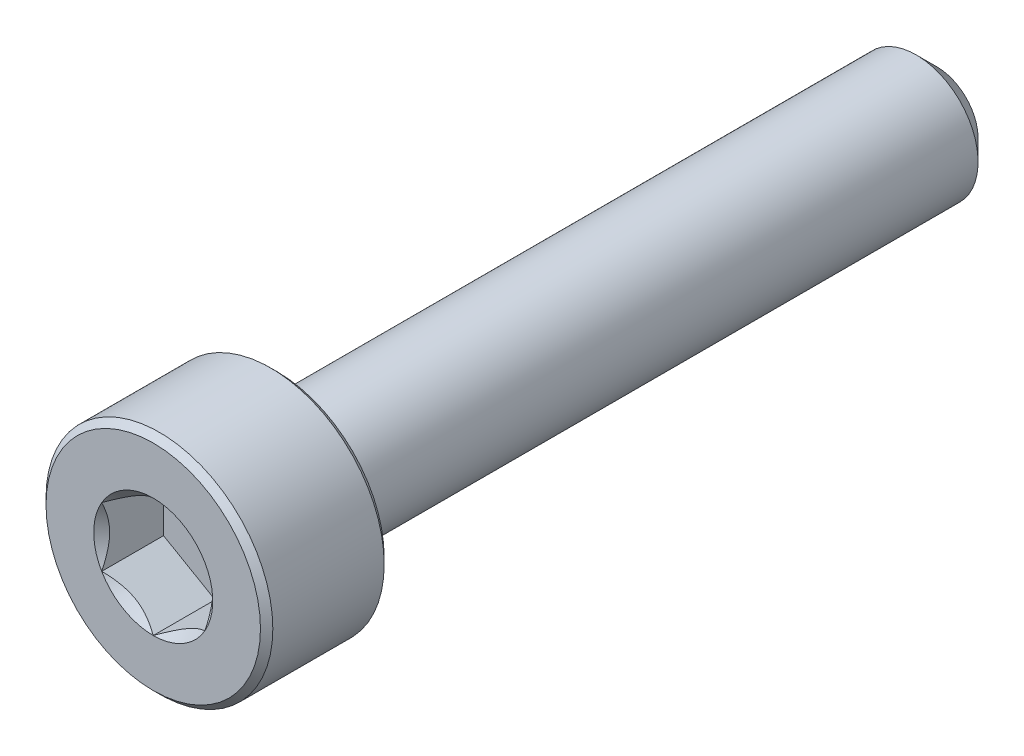
ISO-10303-21;
HEADER;
FILE_DESCRIPTION(('STEP AP214'),'2;1');
FILE_NAME('part.step','',(''),(''),'','','');
FILE_SCHEMA(('AUTOMOTIVE_DESIGN { 1 0 10303 214 1 1 1 1 }'));
ENDSEC;
DATA;
#1=APPLICATION_CONTEXT('core data for automotive mechanical design processes');
#2=APPLICATION_PROTOCOL_DEFINITION('international standard','automotive_design',2000,#1);
#3=PRODUCT_CONTEXT('',#1,'mechanical');
#4=PRODUCT('Part','Part','',(#3));
#5=PRODUCT_RELATED_PRODUCT_CATEGORY('part','',(#4));
#6=PRODUCT_DEFINITION_FORMATION('','',#4);
#7=PRODUCT_DEFINITION_CONTEXT('part definition',#1,'design');
#8=PRODUCT_DEFINITION('design','',#6,#7);
#9=PRODUCT_DEFINITION_SHAPE('','',#8);
#10=(LENGTH_UNIT() NAMED_UNIT(*) SI_UNIT(.MILLI.,.METRE.));
#11=(NAMED_UNIT(*) PLANE_ANGLE_UNIT() SI_UNIT($,.RADIAN.));
#12=(NAMED_UNIT(*) SI_UNIT($,.STERADIAN.) SOLID_ANGLE_UNIT());
#13=UNCERTAINTY_MEASURE_WITH_UNIT(LENGTH_MEASURE(1.E-05),#10,'distance_accuracy_value','');
#14=(GEOMETRIC_REPRESENTATION_CONTEXT(3) GLOBAL_UNCERTAINTY_ASSIGNED_CONTEXT((#13)) GLOBAL_UNIT_ASSIGNED_CONTEXT((#10,
#11,#12)) REPRESENTATION_CONTEXT('',''));
#15=CARTESIAN_POINT('',(0.,0.,0.));
#16=DIRECTION('',(0.,0.,1.));
#17=DIRECTION('',(1.,0.,0.));
#18=AXIS2_PLACEMENT_3D('',#15,#16,#17);
#19=CARTESIAN_POINT('',(0.,2.6,9.5));
#20=DIRECTION('',(0.,0.,1.));
#21=DIRECTION('',(1.,0.,0.));
#22=AXIS2_PLACEMENT_3D('',#19,#20,#21);
#23=PLANE('',#22);
#24=CARTESIAN_POINT('',(0.,0.,9.5));
#25=DIRECTION('',(0.,0.,1.));
#26=DIRECTION('',(1.,0.,0.));
#27=AXIS2_PLACEMENT_3D('',#24,#25,#26);
#28=CIRCLE('',#27,1.44337567297406);
#29=CARTESIAN_POINT('',(1.25,0.721687836487032,9.5));
#30=VERTEX_POINT('',#29);
#31=CARTESIAN_POINT('',(0.,1.44337567297406,9.5));
#32=VERTEX_POINT('',#31);
#33=EDGE_CURVE('E92',#30,#32,#28,.T.);
#34=ORIENTED_EDGE('',*,*,#33,.F.);
#35=CARTESIAN_POINT('',(1.25,-0.721687836487033,9.5));
#36=VERTEX_POINT('',#35);
#37=EDGE_CURVE('E52',#36,#30,#28,.T.);
#38=ORIENTED_EDGE('',*,*,#37,.F.);
#39=CARTESIAN_POINT('',(0.,-1.44337567297406,9.5));
#40=VERTEX_POINT('',#39);
#41=EDGE_CURVE('E278',#40,#36,#28,.T.);
#42=ORIENTED_EDGE('',*,*,#41,.F.);
#43=CARTESIAN_POINT('',(-1.25,-0.72168783648703,9.5));
#44=VERTEX_POINT('',#43);
#45=EDGE_CURVE('E59',#44,#40,#28,.T.);
#46=ORIENTED_EDGE('',*,*,#45,.F.);
#47=CARTESIAN_POINT('',(-1.25,0.721687836487034,9.5));
#48=VERTEX_POINT('',#47);
#49=EDGE_CURVE('E128',#48,#44,#28,.T.);
#50=ORIENTED_EDGE('',*,*,#49,.F.);
#51=EDGE_CURVE('E101',#32,#48,#28,.T.);
#52=ORIENTED_EDGE('',*,*,#51,.F.);
#53=EDGE_LOOP('',(#34,#38,#42,#46,#50,#52));
#54=FACE_BOUND('',#53,.T.);
#55=CARTESIAN_POINT('',(0.,0.,9.5));
#56=DIRECTION('',(0.,0.,-1.));
#57=DIRECTION('',(-1.,0.,0.));
#58=AXIS2_PLACEMENT_3D('',#55,#56,#57);
#59=CIRCLE('',#58,2.6);
#60=CARTESIAN_POINT('',(-2.6,0.,9.5));
#61=VERTEX_POINT('',#60);
#62=EDGE_CURVE('E46',#61,#61,#59,.T.);
#63=ORIENTED_EDGE('',*,*,#62,.F.);
#64=EDGE_LOOP('',(#63));
#65=FACE_BOUND('',#64,.T.);
#66=ADVANCED_FACE('F33',(#54,#65),#23,.T.);
#67=CARTESIAN_POINT('',(0.,0.,9.35));
#68=DIRECTION('',(0.,0.,-1.));
#69=DIRECTION('',(-1.,0.,0.));
#70=AXIS2_PLACEMENT_3D('',#67,#68,#69);
#71=CONICAL_SURFACE('',#70,2.75,0.785398163397445);
#72=ORIENTED_EDGE('',*,*,#62,.T.);
#73=EDGE_LOOP('',(#72));
#74=FACE_BOUND('',#73,.T.);
#75=CARTESIAN_POINT('',(0.,0.,9.35));
#76=DIRECTION('',(0.,0.,-1.));
#77=DIRECTION('',(-1.,0.,0.));
#78=AXIS2_PLACEMENT_3D('',#75,#76,#77);
#79=CIRCLE('',#78,2.75);
#80=CARTESIAN_POINT('',(-2.75,0.,9.35));
#81=VERTEX_POINT('',#80);
#82=EDGE_CURVE('E212',#81,#81,#79,.T.);
#83=ORIENTED_EDGE('',*,*,#82,.F.);
#84=EDGE_LOOP('',(#83));
#85=FACE_BOUND('',#84,.T.);
#86=ADVANCED_FACE('F217',(#74,#85),#71,.T.);
#87=CARTESIAN_POINT('',(0.,0.,-9.5));
#88=DIRECTION('',(0.,0.,-1.));
#89=DIRECTION('',(-1.,0.,0.));
#90=AXIS2_PLACEMENT_3D('',#87,#88,#89);
#91=CYLINDRICAL_SURFACE('',#90,2.75);
#92=ORIENTED_EDGE('',*,*,#82,.T.);
#93=EDGE_LOOP('',(#92));
#94=FACE_BOUND('',#93,.T.);
#95=CARTESIAN_POINT('',(0.,0.,6.65));
#96=DIRECTION('',(0.,0.,-1.));
#97=DIRECTION('',(-1.,0.,0.));
#98=AXIS2_PLACEMENT_3D('',#95,#96,#97);
#99=CIRCLE('',#98,2.75);
#100=CARTESIAN_POINT('',(-2.75,0.,6.65));
#101=VERTEX_POINT('',#100);
#102=EDGE_CURVE('E209',#101,#101,#99,.T.);
#103=ORIENTED_EDGE('',*,*,#102,.F.);
#104=EDGE_LOOP('',(#103));
#105=FACE_BOUND('',#104,.T.);
#106=ADVANCED_FACE('F223',(#94,#105),#91,.T.);
#107=CARTESIAN_POINT('',(0.,0.,6.5));
#108=DIRECTION('',(0.,0.,1.));
#109=DIRECTION('',(1.,0.,0.));
#110=AXIS2_PLACEMENT_3D('',#107,#108,#109);
#111=CONICAL_SURFACE('',#110,2.6,0.785398163397445);
#112=ORIENTED_EDGE('',*,*,#102,.T.);
#113=EDGE_LOOP('',(#112));
#114=FACE_BOUND('',#113,.T.);
#115=CARTESIAN_POINT('',(0.,0.,6.5));
#116=DIRECTION('',(0.,0.,-1.));
#117=DIRECTION('',(-1.,0.,0.));
#118=AXIS2_PLACEMENT_3D('',#115,#116,#117);
#119=CIRCLE('',#118,2.6);
#120=CARTESIAN_POINT('',(-2.6,0.,6.5));
#121=VERTEX_POINT('',#120);
#122=EDGE_CURVE('E206',#121,#121,#119,.T.);
#123=ORIENTED_EDGE('',*,*,#122,.F.);
#124=EDGE_LOOP('',(#123));
#125=FACE_BOUND('',#124,.T.);
#126=ADVANCED_FACE('F227',(#114,#125),#111,.T.);
#127=CARTESIAN_POINT('',(0.,2.6,6.5));
#128=DIRECTION('',(0.,0.,-1.));
#129=DIRECTION('',(-1.,0.,0.));
#130=AXIS2_PLACEMENT_3D('',#127,#128,#129);
#131=PLANE('',#130);
#132=ORIENTED_EDGE('',*,*,#122,.T.);
#133=EDGE_LOOP('',(#132));
#134=FACE_BOUND('',#133,.T.);
#135=CARTESIAN_POINT('',(0.,0.,6.5));
#136=DIRECTION('',(0.,0.,-1.));
#137=DIRECTION('',(-1.,0.,0.));
#138=AXIS2_PLACEMENT_3D('',#135,#136,#137);
#139=CIRCLE('',#138,1.5);
#140=CARTESIAN_POINT('',(-1.5,0.,6.5));
#141=VERTEX_POINT('',#140);
#142=EDGE_CURVE('E203',#141,#141,#139,.T.);
#143=ORIENTED_EDGE('',*,*,#142,.F.);
#144=EDGE_LOOP('',(#143));
#145=FACE_BOUND('',#144,.T.);
#146=ADVANCED_FACE('F233',(#134,#145),#131,.T.);
#147=CARTESIAN_POINT('',(0.,0.,-9.5));
#148=DIRECTION('',(0.,0.,-1.));
#149=DIRECTION('',(-1.,0.,0.));
#150=AXIS2_PLACEMENT_3D('',#147,#148,#149);
#151=CYLINDRICAL_SURFACE('',#150,1.5);
#152=ORIENTED_EDGE('',*,*,#142,.T.);
#153=EDGE_LOOP('',(#152));
#154=FACE_BOUND('',#153,.T.);
#155=CARTESIAN_POINT('',(0.,0.,-8.99999999999999));
#156=DIRECTION('',(0.,0.,-1.));
#157=DIRECTION('',(-1.,0.,0.));
#158=AXIS2_PLACEMENT_3D('',#155,#156,#157);
#159=CIRCLE('',#158,1.5);
#160=CARTESIAN_POINT('',(-1.5,0.,-8.99999999999999));
#161=VERTEX_POINT('',#160);
#162=EDGE_CURVE('E200',#161,#161,#159,.T.);
#163=ORIENTED_EDGE('',*,*,#162,.F.);
#164=EDGE_LOOP('',(#163));
#165=FACE_BOUND('',#164,.T.);
#166=ADVANCED_FACE('F237',(#154,#165),#151,.T.);
#167=CARTESIAN_POINT('',(0.,0.,-9.5));
#168=DIRECTION('',(0.,0.,1.));
#169=DIRECTION('',(1.,0.,0.));
#170=AXIS2_PLACEMENT_3D('',#167,#168,#169);
#171=CONICAL_SURFACE('',#170,1.,0.785398163397443);
#172=ORIENTED_EDGE('',*,*,#162,.T.);
#173=EDGE_LOOP('',(#172));
#174=FACE_BOUND('',#173,.T.);
#175=CARTESIAN_POINT('',(0.,0.,-9.5));
#176=DIRECTION('',(0.,0.,-1.));
#177=DIRECTION('',(-1.,0.,0.));
#178=AXIS2_PLACEMENT_3D('',#175,#176,#177);
#179=CIRCLE('',#178,1.);
#180=CARTESIAN_POINT('',(-1.,0.,-9.5));
#181=VERTEX_POINT('',#180);
#182=EDGE_CURVE('E188',#181,#181,#179,.T.);
#183=ORIENTED_EDGE('',*,*,#182,.F.);
#184=EDGE_LOOP('',(#183));
#185=FACE_BOUND('',#184,.T.);
#186=ADVANCED_FACE('F240',(#174,#185),#171,.T.);
#187=CARTESIAN_POINT('',(0.,1.,-9.5));
#188=DIRECTION('',(0.,0.,-1.));
#189=DIRECTION('',(-1.,0.,0.));
#190=AXIS2_PLACEMENT_3D('',#187,#188,#189);
#191=PLANE('',#190);
#192=ORIENTED_EDGE('',*,*,#182,.T.);
#193=EDGE_LOOP('',(#192));
#194=FACE_BOUND('',#193,.T.);
#195=ADVANCED_FACE('F161',(#194),#191,.T.);
#196=CARTESIAN_POINT('',(0.,0.,9.5));
#197=DIRECTION('',(0.,0.,1.));
#198=DIRECTION('',(1.,0.,0.));
#199=AXIS2_PLACEMENT_3D('',#196,#197,#198);
#200=CONICAL_SURFACE('',#199,1.44337567297406,0.78539816339745);
#201=ORIENTED_EDGE('',*,*,#51,.T.);
#202=CARTESIAN_POINT('',(0.000199999999999744,1.4434911430279,9.50011548390914));
#203=CARTESIAN_POINT('',(-0.0427751670715867,1.41867941875065,9.47532166805511));
#204=CARTESIAN_POINT('',(-0.086469004745948,1.39345276980743,9.45198373441869));
#205=CARTESIAN_POINT('',(-0.175565930841942,1.34201263554194,9.40925200408454));
#206=CARTESIAN_POINT('',(-0.220977498357064,1.31579425481276,9.38988199236042));
#207=CARTESIAN_POINT('',(-0.312547820935259,1.26292610442246,9.35670048341348));
#208=CARTESIAN_POINT('',(-0.358683240175885,1.23628980770471,9.34280555905266));
#209=CARTESIAN_POINT('',(-0.451970080407592,1.18243062538508,9.32139728216064));
#210=CARTESIAN_POINT('',(-0.499118649136379,1.15520938653761,9.31386794156679));
#211=CARTESIAN_POINT('',(-0.580373556887251,1.10829684367467,9.3070744980507));
#212=CARTESIAN_POINT('',(-0.61437487662794,1.08866617256958,9.30606855910435));
#213=CARTESIAN_POINT('',(-0.682317764432477,1.04943932800611,9.30776141491132));
#214=CARTESIAN_POINT('',(-0.716259317655657,1.02984316311599,9.31046102721554));
#215=CARTESIAN_POINT('',(-0.783814856457499,0.9908399546035,9.31940893031638));
#216=CARTESIAN_POINT('',(-0.817428507286774,0.971433104248772,9.32566052589971));
#217=CARTESIAN_POINT('',(-0.884094638217812,0.932943395609906,9.34137568141391));
#218=CARTESIAN_POINT('',(-0.917146871030295,0.913860680098301,9.35084062008746));
#219=CARTESIAN_POINT('',(-1.00179969160026,0.864986351354569,9.37893139068759));
#220=CARTESIAN_POINT('',(-1.05286649242964,0.835502920149077,9.3996701574522));
#221=CARTESIAN_POINT('',(-1.15300085411325,0.777690319475909,9.44638713467148));
#222=CARTESIAN_POINT('',(-1.20207431157827,0.749357745598417,9.47234829594677));
#223=CARTESIAN_POINT('',(-1.2502,0.721572366433195,9.50011548390914));
#224=B_SPLINE_CURVE_WITH_KNOTS('',3,(#202,#203,#204,#205,#206,#207,#208,#209,#210,#211,#212,
#213,#214,#215,#216,#217,#218,#219,#220,#221,#222,#223),.UNSPECIFIED.,.F.,.F.,(4,2,2,2,2,2,2,2,
2,2,4),(0.,0.166533409618303,0.334037607289761,0.498880396489698,0.663307919240273,
0.780963963458825,0.898645970148452,1.01643764860773,1.13427993171549,1.32148652032141,
1.50809158792573),.UNSPECIFIED.);
#225=EDGE_CURVE('E11',#32,#48,#224,.T.);
#226=ORIENTED_EDGE('',*,*,#225,.F.);
#227=EDGE_LOOP('',(#201,#226));
#228=FACE_BOUND('',#227,.T.);
#229=ADVANCED_FACE('F105',(#228),#200,.F.);
#230=ORIENTED_EDGE('',*,*,#49,.T.);
#231=CARTESIAN_POINT('',(-1.25,-1.38510182026143,9.92237003651893));
#232=CARTESIAN_POINT('',(-1.25,-1.35111986791654,9.89714624624165));
#233=CARTESIAN_POINT('',(-1.25,-1.31694282798165,9.87218595709871));
#234=CARTESIAN_POINT('',(-1.25,-1.24812142703778,9.82289946459782));
#235=CARTESIAN_POINT('',(-1.25,-1.21347694519278,9.79857343015524));
#236=CARTESIAN_POINT('',(-1.25,-1.10822083307585,9.72636172374247));
#237=CARTESIAN_POINT('',(-1.25,-1.03680313809814,9.67963105654718));
#238=CARTESIAN_POINT('',(-1.25,-0.887382774503049,9.58837288422405));
#239=CARTESIAN_POINT('',(-1.25,-0.809230860354648,9.54408680062095));
#240=CARTESIAN_POINT('',(-1.25,-0.64909596962788,9.46341771993846));
#241=CARTESIAN_POINT('',(-1.25,-0.567127025778807,9.42700818374294));
#242=CARTESIAN_POINT('',(-1.25,-0.443557329507032,9.38248253765294));
#243=CARTESIAN_POINT('',(-1.25,-0.403672751512106,9.36961750891589));
#244=CARTESIAN_POINT('',(-1.25,-0.322988211982144,9.34709732599784));
#245=CARTESIAN_POINT('',(-1.25,-0.282188183066514,9.33744240892579));
#246=CARTESIAN_POINT('',(-1.25,-0.200572985420666,9.32199119638416));
#247=CARTESIAN_POINT('',(-1.25,-0.159769911896365,9.31613197737595));
#248=CARTESIAN_POINT('',(-1.25,-0.0777868304089238,9.30837795446847));
#249=CARTESIAN_POINT('',(-1.25,-0.0366068784025135,9.30648257133364));
#250=CARTESIAN_POINT('',(-1.25,0.0444682995491154,9.30677812945619));
#251=CARTESIAN_POINT('',(-1.25,0.0843640378229438,9.30884503442731));
#252=CARTESIAN_POINT('',(-1.25,0.163790547253528,9.31668957022574));
#253=CARTESIAN_POINT('',(-1.25,0.203321243504861,9.3224679461945));
#254=CARTESIAN_POINT('',(-1.25,0.282393986569086,9.33752741684667));
#255=CARTESIAN_POINT('',(-1.25,0.321924894821446,9.34686615693867));
#256=CARTESIAN_POINT('',(-1.25,0.400129025325507,9.36856655334425));
#257=CARTESIAN_POINT('',(-1.25,0.438802336675167,9.380927894012));
#258=CARTESIAN_POINT('',(-1.25,0.563172796674043,9.42526147457396));
#259=CARTESIAN_POINT('',(-1.25,0.647028633361639,9.46238856081833));
#260=CARTESIAN_POINT('',(-1.25,0.810774511829943,9.54485212067595));
#261=CARTESIAN_POINT('',(-1.25,0.890648632035887,9.59021863392705));
#262=CARTESIAN_POINT('',(-1.25,1.04325497137231,9.68372167893417));
#263=CARTESIAN_POINT('',(-1.25,1.11614441495489,9.73160472191527));
#264=CARTESIAN_POINT('',(-1.25,1.22353402780521,9.80558839420389));
#265=CARTESIAN_POINT('',(-1.25,1.25886567990417,9.83050307314204));
#266=CARTESIAN_POINT('',(-1.25,1.32904842299966,9.88098117650382));
#267=CARTESIAN_POINT('',(-1.25,1.36389964210964,9.90654442260415));
#268=CARTESIAN_POINT('',(-1.25,1.39855118205095,9.93237628525925));
#269=B_SPLINE_CURVE_WITH_KNOTS('',3,(#231,#232,#233,#234,#235,#236,#237,#238,#239,#240,#241,
#242,#243,#244,#245,#246,#247,#248,#249,#250,#251,#252,#253,#254,#255,#256,#257,#258,#259,#260,
#261,#262,#263,#264,#265,#266,#267,#268),.UNSPECIFIED.,.F.,.F.,(4,2,2,2,2,2,2,2,2,2,2,2,2,2,2,2,
2,2,4),(0.,0.126957685892467,0.253948844888987,0.509869208273041,0.77911544356967,
1.04743984536898,1.17305649245659,1.29868241592515,1.42216852630225,1.5456365903859,
1.6653025991614,1.78499264045314,1.90670905612004,2.02841276654157,2.30272027119573,
2.57804870101489,2.83955156876987,2.96924486861395,3.09890288771825),.UNSPECIFIED.);
#270=EDGE_CURVE('E100',#48,#44,#269,.F.);
#271=ORIENTED_EDGE('',*,*,#270,.F.);
#272=EDGE_LOOP('',(#230,#271));
#273=FACE_BOUND('',#272,.T.);
#274=ADVANCED_FACE('F255',(#273),#200,.F.);
#275=ORIENTED_EDGE('',*,*,#45,.T.);
#276=CARTESIAN_POINT('',(-1.2502,-0.721572366433195,9.50011548390914));
#277=CARTESIAN_POINT('',(-1.20722483292841,-0.746384090710444,9.47532166805511));
#278=CARTESIAN_POINT('',(-1.16353099525405,-0.771610739653664,9.45198373441869));
#279=CARTESIAN_POINT('',(-1.07443406915806,-0.823050873919154,9.40925200408454));
#280=CARTESIAN_POINT('',(-1.02902250164294,-0.849269254648333,9.38988199236042));
#281=CARTESIAN_POINT('',(-0.937452179064742,-0.902137405038635,9.35670048341348));
#282=CARTESIAN_POINT('',(-0.891316759824117,-0.928773701756386,9.34280555905266));
#283=CARTESIAN_POINT('',(-0.79802991959241,-0.982632884076012,9.32139728216064));
#284=CARTESIAN_POINT('',(-0.750881350863622,-1.00985412292348,9.31386794156679));
#285=CARTESIAN_POINT('',(-0.66962644311275,-1.05676666578643,9.3070744980507));
#286=CARTESIAN_POINT('',(-0.635625123372061,-1.07639733689152,9.30606855910435));
#287=CARTESIAN_POINT('',(-0.567682235567525,-1.11562418145499,9.30776141491132));
#288=CARTESIAN_POINT('',(-0.533740682344345,-1.1352203463451,9.31046102721554));
#289=CARTESIAN_POINT('',(-0.466185143542503,-1.1742235548576,9.31940893031638));
#290=CARTESIAN_POINT('',(-0.432571492713227,-1.19363040521232,9.32566052589971));
#291=CARTESIAN_POINT('',(-0.365905361782189,-1.23212011385119,9.34137568141391));
#292=CARTESIAN_POINT('',(-0.332853128969707,-1.2512028293628,9.35084062008746));
#293=CARTESIAN_POINT('',(-0.248200308399738,-1.30007715810653,9.37893139068759));
#294=CARTESIAN_POINT('',(-0.197133507570363,-1.32956058931202,9.3996701574522));
#295=CARTESIAN_POINT('',(-0.0969991458867461,-1.38737318998519,9.44638713467148));
#296=CARTESIAN_POINT('',(-0.0479256884217311,-1.41570576386268,9.47234829594677));
#297=CARTESIAN_POINT('',(0.000199999999999774,-1.4434911430279,9.50011548390914));
#298=B_SPLINE_CURVE_WITH_KNOTS('',3,(#276,#277,#278,#279,#280,#281,#282,#283,#284,#285,#286,
#287,#288,#289,#290,#291,#292,#293,#294,#295,#296,#297),.UNSPECIFIED.,.F.,.F.,(4,2,2,2,2,2,2,2,
2,2,4),(0.,0.166533409618303,0.33403760728976,0.498880396489696,0.663307919240272,
0.780963963458825,0.898645970148451,1.01643764860773,1.13427993171549,1.32148652032141,
1.50809158792574),.UNSPECIFIED.);
#299=EDGE_CURVE('E137',#44,#40,#298,.T.);
#300=ORIENTED_EDGE('',*,*,#299,.F.);
#301=EDGE_LOOP('',(#275,#300));
#302=FACE_BOUND('',#301,.T.);
#303=ADVANCED_FACE('F259',(#302),#200,.F.);
#304=ORIENTED_EDGE('',*,*,#41,.T.);
#305=CARTESIAN_POINT('',(-0.000200000000000316,-1.4434911430279,9.50011548390914));
#306=CARTESIAN_POINT('',(0.0427751670715859,-1.41867941875065,9.47532166805511));
#307=CARTESIAN_POINT('',(0.0864690047459471,-1.39345276980743,9.45198373441869));
#308=CARTESIAN_POINT('',(0.175565930841941,-1.34201263554194,9.40925200408454));
#309=CARTESIAN_POINT('',(0.220977498357063,-1.31579425481276,9.38988199236042));
#310=CARTESIAN_POINT('',(0.312547820935259,-1.26292610442246,9.35670048341348));
#311=CARTESIAN_POINT('',(0.358683240175885,-1.23628980770471,9.34280555905266));
#312=CARTESIAN_POINT('',(0.451970080407591,-1.18243062538509,9.32139728216064));
#313=CARTESIAN_POINT('',(0.499118649136378,-1.15520938653761,9.31386794156679));
#314=CARTESIAN_POINT('',(0.58037355688725,-1.10829684367467,9.3070744980507));
#315=CARTESIAN_POINT('',(0.614374876627939,-1.08866617256958,9.30606855910435));
#316=CARTESIAN_POINT('',(0.682317764432475,-1.04943932800611,9.30776141491132));
#317=CARTESIAN_POINT('',(0.716259317655655,-1.02984316311599,9.31046102721554));
#318=CARTESIAN_POINT('',(0.783814856457497,-0.990839954603501,9.31940893031638));
#319=CARTESIAN_POINT('',(0.817428507286773,-0.971433104248773,9.32566052589971));
#320=CARTESIAN_POINT('',(0.884094638217811,-0.932943395609907,9.34137568141391));
#321=CARTESIAN_POINT('',(0.917146871030293,-0.913860680098302,9.35084062008746));
#322=CARTESIAN_POINT('',(1.00179969160026,-0.864986351354569,9.37893139068759));
#323=CARTESIAN_POINT('',(1.05286649242964,-0.835502920149077,9.3996701574522));
#324=CARTESIAN_POINT('',(1.15300085411325,-0.77769031947591,9.44638713467148));
#325=CARTESIAN_POINT('',(1.20207431157827,-0.749357745598418,9.47234829594677));
#326=CARTESIAN_POINT('',(1.2502,-0.721572366433196,9.50011548390914));
#327=B_SPLINE_CURVE_WITH_KNOTS('',3,(#305,#306,#307,#308,#309,#310,#311,#312,#313,#314,#315,
#316,#317,#318,#319,#320,#321,#322,#323,#324,#325,#326),.UNSPECIFIED.,.F.,.F.,(4,2,2,2,2,2,2,2,
2,2,4),(0.,0.166533409618303,0.334037607289761,0.498880396489697,0.663307919240272,
0.780963963458824,0.89864597014845,1.01643764860773,1.13427993171549,1.32148652032141,
1.50809158792573),.UNSPECIFIED.);
#328=EDGE_CURVE('E280',#40,#36,#327,.T.);
#329=ORIENTED_EDGE('',*,*,#328,.F.);
#330=EDGE_LOOP('',(#304,#329));
#331=FACE_BOUND('',#330,.T.);
#332=ADVANCED_FACE('F268',(#331),#200,.F.);
#333=ORIENTED_EDGE('',*,*,#37,.T.);
#334=CARTESIAN_POINT('',(1.25,-1.38510181874983,9.92237003539674));
#335=CARTESIAN_POINT('',(1.25,-1.3511198664462,9.89714624516244));
#336=CARTESIAN_POINT('',(1.25,-1.31694282655271,9.87218595606241));
#337=CARTESIAN_POINT('',(1.25,-1.24812142569208,9.82289946364711));
#338=CARTESIAN_POINT('',(1.25,-1.21347694388892,9.7985734292472));
#339=CARTESIAN_POINT('',(1.25,-1.10822083190006,9.72636172296323));
#340=CARTESIAN_POINT('',(1.25,-1.0368031370095,9.67963105585343));
#341=CARTESIAN_POINT('',(1.25,-0.887382773604423,9.58837288370571));
#342=CARTESIAN_POINT('',(1.25,-0.809230859559388,9.54408680019188));
#343=CARTESIAN_POINT('',(1.25,-0.649095969048193,9.46341771967474));
#344=CARTESIAN_POINT('',(1.25,-0.567127025311258,9.42700818355541));
#345=CARTESIAN_POINT('',(1.25,-0.443557329124526,9.38248253752399));
#346=CARTESIAN_POINT('',(1.25,-0.403672751095207,9.36961750878661));
#347=CARTESIAN_POINT('',(1.25,-0.322988211495525,9.34709732587494));
#348=CARTESIAN_POINT('',(1.25,-0.28218818254457,9.3374424088096));
#349=CARTESIAN_POINT('',(1.25,-0.200572984829335,9.32199119628928));
#350=CARTESIAN_POINT('',(1.25,-0.159769911270982,9.31613197729548));
#351=CARTESIAN_POINT('',(1.25,-0.0777868297167931,9.30837795442431));
#352=CARTESIAN_POINT('',(1.25,-0.0366068776776872,9.30648257131138));
#353=CARTESIAN_POINT('',(1.25,0.0444683003388063,9.30677812948321));
#354=CARTESIAN_POINT('',(1.25,0.0843640386448798,9.3088450344818));
#355=CARTESIAN_POINT('',(1.25,0.16379054813703,9.3166895703397));
#356=CARTESIAN_POINT('',(1.25,0.203321244417683,9.32246794634046));
#357=CARTESIAN_POINT('',(1.25,0.282393987539771,9.33752741705993));
#358=CARTESIAN_POINT('',(1.25,0.321924895820597,9.34686615718743));
#359=CARTESIAN_POINT('',(1.25,0.400129026379049,9.36856655366507));
#360=CARTESIAN_POINT('',(1.25,0.438802337754634,9.38092789436938));
#361=CARTESIAN_POINT('',(1.25,0.563172797994067,9.42526147510657));
#362=CARTESIAN_POINT('',(1.25,0.647028634884196,9.46238856151275));
#363=CARTESIAN_POINT('',(1.25,0.810774513742064,9.54485212171168));
#364=CARTESIAN_POINT('',(1.25,0.89064863413494,9.59021863514241));
#365=CARTESIAN_POINT('',(1.25,1.04325497380786,9.68372168049333));
#366=CARTESIAN_POINT('',(1.25,1.11614441754118,9.73160472363706));
#367=CARTESIAN_POINT('',(1.25,1.22353403061444,9.8055883961688));
#368=CARTESIAN_POINT('',(1.25,1.25886568278664,9.83050307518733));
#369=CARTESIAN_POINT('',(1.25,1.32904842602817,9.8809811787098));
#370=CARTESIAN_POINT('',(1.25,1.36389964521094,9.90654442489043));
#371=CARTESIAN_POINT('',(1.25,1.39855118522491,9.93237628762573));
#372=B_SPLINE_CURVE_WITH_KNOTS('',3,(#334,#335,#336,#337,#338,#339,#340,#341,#342,#343,#344,
#345,#346,#347,#348,#349,#350,#351,#352,#353,#354,#355,#356,#357,#358,#359,#360,#361,#362,#363,
#364,#365,#366,#367,#368,#369,#370,#371),.UNSPECIFIED.,.F.,.F.,(4,2,2,2,2,2,2,2,2,2,2,2,2,2,2,2,
2,2,4),(0.,0.126957685716233,0.253948844536466,0.509869207561398,0.779115442456377,
1.04743984385779,1.17305649104353,1.29868241461005,1.42216852508156,1.54563658925964,
1.66530259813563,1.78499263952808,1.90670905530249,2.02841276583151,2.30272027123448,
2.57804870180744,2.83955157020837,2.96924487037104,3.0989028897939),.UNSPECIFIED.);
#373=EDGE_CURVE('E117',#36,#30,#372,.T.);
#374=ORIENTED_EDGE('',*,*,#373,.F.);
#375=EDGE_LOOP('',(#333,#374));
#376=FACE_BOUND('',#375,.T.);
#377=ADVANCED_FACE('F262',(#376),#200,.F.);
#378=ORIENTED_EDGE('',*,*,#33,.T.);
#379=CARTESIAN_POINT('',(1.2502,0.721572366433195,9.50011548390914));
#380=CARTESIAN_POINT('',(1.20722483292841,0.746384090710445,9.4753216680551));
#381=CARTESIAN_POINT('',(1.16353099525405,0.771610739653665,9.45198373441868));
#382=CARTESIAN_POINT('',(1.07443406915806,0.823050873919155,9.40925200408454));
#383=CARTESIAN_POINT('',(1.02902250164294,0.849269254648334,9.38988199236042));
#384=CARTESIAN_POINT('',(0.937452179064739,0.902137405038636,9.35670048341348));
#385=CARTESIAN_POINT('',(0.891316759824113,0.928773701756387,9.34280555905266));
#386=CARTESIAN_POINT('',(0.798029919592407,0.982632884076013,9.32139728216064));
#387=CARTESIAN_POINT('',(0.75088135086362,1.00985412292348,9.31386794156679));
#388=CARTESIAN_POINT('',(0.669626443112747,1.05676666578643,9.3070744980507));
#389=CARTESIAN_POINT('',(0.635625123372058,1.07639733689152,9.30606855910435));
#390=CARTESIAN_POINT('',(0.567682235567522,1.11562418145499,9.30776141491132));
#391=CARTESIAN_POINT('',(0.533740682344342,1.1352203463451,9.31046102721554));
#392=CARTESIAN_POINT('',(0.4661851435425,1.1742235548576,9.31940893031638));
#393=CARTESIAN_POINT('',(0.432571492713225,1.19363040521233,9.32566052589971));
#394=CARTESIAN_POINT('',(0.365905361782186,1.23212011385119,9.34137568141391));
#395=CARTESIAN_POINT('',(0.332853128969704,1.2512028293628,9.35084062008746));
#396=CARTESIAN_POINT('',(0.248200308399735,1.30007715810653,9.37893139068759));
#397=CARTESIAN_POINT('',(0.197133507570361,1.32956058931202,9.3996701574522));
#398=CARTESIAN_POINT('',(0.0969991458867446,1.38737318998519,9.44638713467148));
#399=CARTESIAN_POINT('',(0.04792568842173,1.41570576386268,9.47234829594677));
#400=CARTESIAN_POINT('',(-0.00020000000000024,1.4434911430279,9.50011548390914));
#401=B_SPLINE_CURVE_WITH_KNOTS('',3,(#379,#380,#381,#382,#383,#384,#385,#386,#387,#388,#389,
#390,#391,#392,#393,#394,#395,#396,#397,#398,#399,#400),.UNSPECIFIED.,.F.,.F.,(4,2,2,2,2,2,2,2,
2,2,4),(0.,0.166533409618304,0.334037607289761,0.498880396489698,0.663307919240274,
0.780963963458826,0.898645970148452,1.01643764860773,1.13427993171549,1.32148652032141,
1.50809158792573),.UNSPECIFIED.);
#402=EDGE_CURVE('E96',#30,#32,#401,.T.);
#403=ORIENTED_EDGE('',*,*,#402,.F.);
#404=EDGE_LOOP('',(#378,#403));
#405=FACE_BOUND('',#404,.T.);
#406=ADVANCED_FACE('F94',(#405),#200,.F.);
#407=CARTESIAN_POINT('',(0.,0.,8.));
#408=DIRECTION('',(0.,0.,1.));
#409=DIRECTION('',(1.,0.,0.));
#410=AXIS2_PLACEMENT_3D('',#407,#408,#409);
#411=PLANE('',#410);
#412=DIRECTION('',(-0.866025403784439,0.5,0.));
#413=VECTOR('',#412,1.);
#414=CARTESIAN_POINT('',(1.25,0.721687836487033,8.));
#415=LINE('',#414,#413);
#416=CARTESIAN_POINT('',(1.25,0.721687836487033,8.));
#417=VERTEX_POINT('',#416);
#418=CARTESIAN_POINT('',(0.,1.44337567297406,8.));
#419=VERTEX_POINT('',#418);
#420=EDGE_CURVE('E116',#417,#419,#415,.T.);
#421=ORIENTED_EDGE('',*,*,#420,.T.);
#422=DIRECTION('',(-0.866025403784439,-0.5,0.));
#423=VECTOR('',#422,1.);
#424=CARTESIAN_POINT('',(0.,1.44337567297406,8.));
#425=LINE('',#424,#423);
#426=CARTESIAN_POINT('',(-1.25,0.721687836487033,8.));
#427=VERTEX_POINT('',#426);
#428=EDGE_CURVE('E121',#419,#427,#425,.T.);
#429=ORIENTED_EDGE('',*,*,#428,.T.);
#430=DIRECTION('',(0.,-1.,0.));
#431=VECTOR('',#430,1.);
#432=CARTESIAN_POINT('',(-1.25,0.721687836487033,8.));
#433=LINE('',#432,#431);
#434=CARTESIAN_POINT('',(-1.25,-0.721687836487032,8.));
#435=VERTEX_POINT('',#434);
#436=EDGE_CURVE('E176',#427,#435,#433,.T.);
#437=ORIENTED_EDGE('',*,*,#436,.T.);
#438=DIRECTION('',(0.866025403784439,-0.5,0.));
#439=VECTOR('',#438,1.);
#440=CARTESIAN_POINT('',(-1.25,-0.721687836487032,8.));
#441=LINE('',#440,#439);
#442=CARTESIAN_POINT('',(0.,-1.44337567297406,8.));
#443=VERTEX_POINT('',#442);
#444=EDGE_CURVE('E179',#435,#443,#441,.T.);
#445=ORIENTED_EDGE('',*,*,#444,.T.);
#446=DIRECTION('',(0.866025403784439,0.5,0.));
#447=VECTOR('',#446,1.);
#448=CARTESIAN_POINT('',(0.,-1.44337567297406,8.));
#449=LINE('',#448,#447);
#450=CARTESIAN_POINT('',(1.25,-0.721687836487033,8.));
#451=VERTEX_POINT('',#450);
#452=EDGE_CURVE('E182',#443,#451,#449,.T.);
#453=ORIENTED_EDGE('',*,*,#452,.T.);
#454=DIRECTION('',(0.,1.,0.));
#455=VECTOR('',#454,1.);
#456=CARTESIAN_POINT('',(1.25,-0.721687836487033,8.));
#457=LINE('',#456,#455);
#458=EDGE_CURVE('E124',#451,#417,#457,.T.);
#459=ORIENTED_EDGE('',*,*,#458,.T.);
#460=EDGE_LOOP('',(#421,#429,#437,#445,#453,#459));
#461=FACE_BOUND('',#460,.T.);
#462=ADVANCED_FACE('F156',(#461),#411,.T.);
#463=CARTESIAN_POINT('',(0.,1.44337567297406,8.));
#464=DIRECTION('',(-0.5,0.866025403784439,0.));
#465=DIRECTION('',(-0.866025403784439,-0.5,0.));
#466=AXIS2_PLACEMENT_3D('',#463,#464,#465);
#467=PLANE('',#466);
#468=DIRECTION('',(0.,0.,1.));
#469=VECTOR('',#468,1.);
#470=CARTESIAN_POINT('',(0.,1.44337567297406,8.));
#471=LINE('',#470,#469);
#472=EDGE_CURVE('E113',#419,#32,#471,.T.);
#473=ORIENTED_EDGE('',*,*,#472,.T.);
#474=ORIENTED_EDGE('',*,*,#225,.T.);
#475=DIRECTION('',(0.,0.,1.));
#476=VECTOR('',#475,1.);
#477=CARTESIAN_POINT('',(-1.25,0.721687836487033,8.));
#478=LINE('',#477,#476);
#479=EDGE_CURVE('E123',#427,#48,#478,.T.);
#480=ORIENTED_EDGE('',*,*,#479,.F.);
#481=ORIENTED_EDGE('',*,*,#428,.F.);
#482=EDGE_LOOP('',(#473,#474,#480,#481));
#483=FACE_BOUND('',#482,.T.);
#484=ADVANCED_FACE('F119',(#483),#467,.F.);
#485=CARTESIAN_POINT('',(-1.25,0.721687836487033,8.));
#486=DIRECTION('',(-1.,0.,0.));
#487=DIRECTION('',(0.,-1.,0.));
#488=AXIS2_PLACEMENT_3D('',#485,#486,#487);
#489=PLANE('',#488);
#490=ORIENTED_EDGE('',*,*,#479,.T.);
#491=ORIENTED_EDGE('',*,*,#270,.T.);
#492=DIRECTION('',(0.,0.,1.));
#493=VECTOR('',#492,1.);
#494=CARTESIAN_POINT('',(-1.25,-0.721687836487032,8.));
#495=LINE('',#494,#493);
#496=EDGE_CURVE('E194',#435,#44,#495,.T.);
#497=ORIENTED_EDGE('',*,*,#496,.F.);
#498=ORIENTED_EDGE('',*,*,#436,.F.);
#499=EDGE_LOOP('',(#490,#491,#497,#498));
#500=FACE_BOUND('',#499,.T.);
#501=ADVANCED_FACE('F146',(#500),#489,.F.);
#502=CARTESIAN_POINT('',(-1.25,-0.721687836487032,8.));
#503=DIRECTION('',(-0.5,-0.866025403784439,0.));
#504=DIRECTION('',(0.866025403784439,-0.5,0.));
#505=AXIS2_PLACEMENT_3D('',#502,#503,#504);
#506=PLANE('',#505);
#507=ORIENTED_EDGE('',*,*,#496,.T.);
#508=ORIENTED_EDGE('',*,*,#299,.T.);
#509=DIRECTION('',(0.,0.,1.));
#510=VECTOR('',#509,1.);
#511=CARTESIAN_POINT('',(0.,-1.44337567297406,8.));
#512=LINE('',#511,#510);
#513=EDGE_CURVE('E191',#443,#40,#512,.T.);
#514=ORIENTED_EDGE('',*,*,#513,.F.);
#515=ORIENTED_EDGE('',*,*,#444,.F.);
#516=EDGE_LOOP('',(#507,#508,#514,#515));
#517=FACE_BOUND('',#516,.T.);
#518=ADVANCED_FACE('F149',(#517),#506,.F.);
#519=CARTESIAN_POINT('',(0.,-1.44337567297406,8.));
#520=DIRECTION('',(0.5,-0.866025403784439,0.));
#521=DIRECTION('',(0.866025403784439,0.5,0.));
#522=AXIS2_PLACEMENT_3D('',#519,#520,#521);
#523=PLANE('',#522);
#524=ORIENTED_EDGE('',*,*,#513,.T.);
#525=ORIENTED_EDGE('',*,*,#328,.T.);
#526=DIRECTION('',(0.,0.,1.));
#527=VECTOR('',#526,1.);
#528=CARTESIAN_POINT('',(1.25,-0.721687836487033,8.));
#529=LINE('',#528,#527);
#530=EDGE_CURVE('E189',#451,#36,#529,.T.);
#531=ORIENTED_EDGE('',*,*,#530,.F.);
#532=ORIENTED_EDGE('',*,*,#452,.F.);
#533=EDGE_LOOP('',(#524,#525,#531,#532));
#534=FACE_BOUND('',#533,.T.);
#535=ADVANCED_FACE('F286',(#534),#523,.F.);
#536=CARTESIAN_POINT('',(1.25,-0.721687836487033,8.));
#537=DIRECTION('',(1.,0.,0.));
#538=DIRECTION('',(0.,1.,0.));
#539=AXIS2_PLACEMENT_3D('',#536,#537,#538);
#540=PLANE('',#539);
#541=ORIENTED_EDGE('',*,*,#530,.T.);
#542=ORIENTED_EDGE('',*,*,#373,.T.);
#543=DIRECTION('',(0.,0.,1.));
#544=VECTOR('',#543,1.);
#545=CARTESIAN_POINT('',(1.25,0.721687836487033,8.));
#546=LINE('',#545,#544);
#547=EDGE_CURVE('E115',#417,#30,#546,.T.);
#548=ORIENTED_EDGE('',*,*,#547,.F.);
#549=ORIENTED_EDGE('',*,*,#458,.F.);
#550=EDGE_LOOP('',(#541,#542,#548,#549));
#551=FACE_BOUND('',#550,.T.);
#552=ADVANCED_FACE('F160',(#551),#540,.F.);
#553=CARTESIAN_POINT('',(1.25,0.721687836487033,8.));
#554=DIRECTION('',(0.5,0.866025403784439,0.));
#555=DIRECTION('',(-0.866025403784439,0.5,0.));
#556=AXIS2_PLACEMENT_3D('',#553,#554,#555);
#557=PLANE('',#556);
#558=ORIENTED_EDGE('',*,*,#547,.T.);
#559=ORIENTED_EDGE('',*,*,#402,.T.);
#560=ORIENTED_EDGE('',*,*,#472,.F.);
#561=ORIENTED_EDGE('',*,*,#420,.F.);
#562=EDGE_LOOP('',(#558,#559,#560,#561));
#563=FACE_BOUND('',#562,.T.);
#564=ADVANCED_FACE('F111',(#563),#557,.F.);
#565=CLOSED_SHELL('',(#66,#86,#106,#126,#146,#166,#186,#195,#229,#274,#303,#332,#377,#406,#462,
#484,#501,#518,#535,#552,#564));
#566=MANIFOLD_SOLID_BREP('B2',#565);
#567=ADVANCED_BREP_SHAPE_REPRESENTATION('',(#18,#566),#14);
#568=SHAPE_DEFINITION_REPRESENTATION(#9,#567);
ENDSEC;
END-ISO-10303-21;
